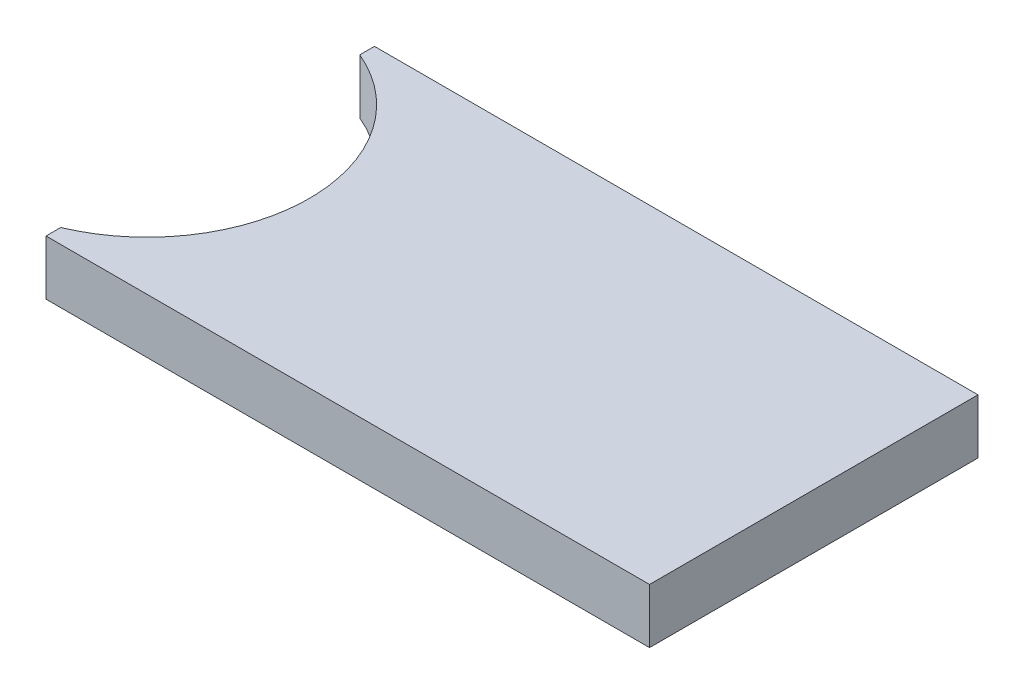
ISO-10303-21;
HEADER;
FILE_DESCRIPTION(('STEP AP214'),'2;1');
FILE_NAME('part.step','',(''),(''),'','','');
FILE_SCHEMA(('AUTOMOTIVE_DESIGN { 1 0 10303 214 1 1 1 1 }'));
ENDSEC;
DATA;
#1=APPLICATION_CONTEXT('core data for automotive mechanical design processes');
#2=APPLICATION_PROTOCOL_DEFINITION('international standard','automotive_design',2000,#1);
#3=PRODUCT_CONTEXT('',#1,'mechanical');
#4=PRODUCT('Part','Part','',(#3));
#5=PRODUCT_RELATED_PRODUCT_CATEGORY('part','',(#4));
#6=PRODUCT_DEFINITION_FORMATION('','',#4);
#7=PRODUCT_DEFINITION_CONTEXT('part definition',#1,'design');
#8=PRODUCT_DEFINITION('design','',#6,#7);
#9=PRODUCT_DEFINITION_SHAPE('','',#8);
#10=(LENGTH_UNIT() NAMED_UNIT(*) SI_UNIT(.MILLI.,.METRE.));
#11=(NAMED_UNIT(*) PLANE_ANGLE_UNIT() SI_UNIT($,.RADIAN.));
#12=(NAMED_UNIT(*) SI_UNIT($,.STERADIAN.) SOLID_ANGLE_UNIT());
#13=UNCERTAINTY_MEASURE_WITH_UNIT(LENGTH_MEASURE(1.E-05),#10,'distance_accuracy_value','');
#14=(GEOMETRIC_REPRESENTATION_CONTEXT(3) GLOBAL_UNCERTAINTY_ASSIGNED_CONTEXT((#13)) GLOBAL_UNIT_ASSIGNED_CONTEXT((#10,
#11,#12)) REPRESENTATION_CONTEXT('',''));
#15=CARTESIAN_POINT('',(0.,0.,0.));
#16=DIRECTION('',(0.,0.,1.));
#17=DIRECTION('',(1.,0.,0.));
#18=AXIS2_PLACEMENT_3D('',#15,#16,#17);
#19=CARTESIAN_POINT('',(110.24962275664,20.,-60.));
#20=DIRECTION('',(-1.,0.,0.));
#21=DIRECTION('',(0.,0.,1.));
#22=AXIS2_PLACEMENT_3D('',#19,#20,#21);
#23=PLANE('',#22);
#24=DIRECTION('',(0.,0.,-1.));
#25=VECTOR('',#24,1.);
#26=CARTESIAN_POINT('',(110.24962275664,0.,-60.));
#27=LINE('',#26,#25);
#28=CARTESIAN_POINT('',(110.24962275664,0.,60.));
#29=VERTEX_POINT('',#28);
#30=CARTESIAN_POINT('',(110.24962275664,0.,-60.));
#31=VERTEX_POINT('',#30);
#32=EDGE_CURVE('E121',#29,#31,#27,.T.);
#33=ORIENTED_EDGE('',*,*,#32,.T.);
#34=DIRECTION('',(0.,-1.,0.));
#35=VECTOR('',#34,1.);
#36=CARTESIAN_POINT('',(110.24962275664,20.,-60.));
#37=LINE('',#36,#35);
#38=CARTESIAN_POINT('',(110.24962275664,20.,-60.));
#39=VERTEX_POINT('',#38);
#40=EDGE_CURVE('E11',#39,#31,#37,.T.);
#41=ORIENTED_EDGE('',*,*,#40,.F.);
#42=DIRECTION('',(0.,0.,-1.));
#43=VECTOR('',#42,1.);
#44=CARTESIAN_POINT('',(110.24962275664,20.,-60.));
#45=LINE('',#44,#43);
#46=CARTESIAN_POINT('',(110.24962275664,20.,60.));
#47=VERTEX_POINT('',#46);
#48=EDGE_CURVE('E131',#47,#39,#45,.T.);
#49=ORIENTED_EDGE('',*,*,#48,.F.);
#50=DIRECTION('',(0.,-1.,0.));
#51=VECTOR('',#50,1.);
#52=CARTESIAN_POINT('',(110.24962275664,20.,60.));
#53=LINE('',#52,#51);
#54=EDGE_CURVE('E117',#47,#29,#53,.T.);
#55=ORIENTED_EDGE('',*,*,#54,.T.);
#56=EDGE_LOOP('',(#33,#41,#49,#55));
#57=FACE_BOUND('',#56,.T.);
#58=ADVANCED_FACE('F37',(#57),#23,.F.);
#59=CARTESIAN_POINT('',(-110.24962275664,20.,-60.));
#60=DIRECTION('',(0.,0.,1.));
#61=DIRECTION('',(1.,0.,0.));
#62=AXIS2_PLACEMENT_3D('',#59,#60,#61);
#63=PLANE('',#62);
#64=DIRECTION('',(-1.,0.,0.));
#65=VECTOR('',#64,1.);
#66=CARTESIAN_POINT('',(-110.24962275664,0.,-60.));
#67=LINE('',#66,#65);
#68=CARTESIAN_POINT('',(-110.24962275664,0.,-60.));
#69=VERTEX_POINT('',#68);
#70=EDGE_CURVE('E124',#31,#69,#67,.T.);
#71=ORIENTED_EDGE('',*,*,#70,.T.);
#72=DIRECTION('',(0.,-1.,0.));
#73=VECTOR('',#72,1.);
#74=CARTESIAN_POINT('',(-110.24962275664,20.,-60.));
#75=LINE('',#74,#73);
#76=CARTESIAN_POINT('',(-110.24962275664,20.,-60.));
#77=VERTEX_POINT('',#76);
#78=EDGE_CURVE('E45',#77,#69,#75,.T.);
#79=ORIENTED_EDGE('',*,*,#78,.F.);
#80=DIRECTION('',(-1.,0.,0.));
#81=VECTOR('',#80,1.);
#82=CARTESIAN_POINT('',(-110.24962275664,20.,-60.));
#83=LINE('',#82,#81);
#84=EDGE_CURVE('E90',#39,#77,#83,.T.);
#85=ORIENTED_EDGE('',*,*,#84,.F.);
#86=ORIENTED_EDGE('',*,*,#40,.T.);
#87=EDGE_LOOP('',(#71,#79,#85,#86));
#88=FACE_BOUND('',#87,.T.);
#89=ADVANCED_FACE('F155',(#88),#63,.F.);
#90=CARTESIAN_POINT('',(-110.24962275664,20.,-60.));
#91=DIRECTION('',(1.,0.,0.));
#92=DIRECTION('',(0.,0.,-1.));
#93=AXIS2_PLACEMENT_3D('',#90,#91,#92);
#94=PLANE('',#93);
#95=DIRECTION('',(0.,0.,1.));
#96=VECTOR('',#95,1.);
#97=CARTESIAN_POINT('',(-110.24962275664,0.,-60.));
#98=LINE('',#97,#96);
#99=CARTESIAN_POINT('',(-110.24962275664,0.,-54.6367530655564));
#100=VERTEX_POINT('',#99);
#101=EDGE_CURVE('E126',#69,#100,#98,.T.);
#102=ORIENTED_EDGE('',*,*,#101,.T.);
#103=DIRECTION('',(0.,-1.,0.));
#104=VECTOR('',#103,1.);
#105=CARTESIAN_POINT('',(-110.24962275664,20.,-54.6367530655564));
#106=LINE('',#105,#104);
#107=CARTESIAN_POINT('',(-110.24962275664,20.,-54.6367530655564));
#108=VERTEX_POINT('',#107);
#109=EDGE_CURVE('E112',#108,#100,#106,.T.);
#110=ORIENTED_EDGE('',*,*,#109,.F.);
#111=DIRECTION('',(0.,0.,1.));
#112=VECTOR('',#111,1.);
#113=CARTESIAN_POINT('',(-110.24962275664,20.,-60.));
#114=LINE('',#113,#112);
#115=EDGE_CURVE('E103',#77,#108,#114,.T.);
#116=ORIENTED_EDGE('',*,*,#115,.F.);
#117=ORIENTED_EDGE('',*,*,#78,.T.);
#118=EDGE_LOOP('',(#102,#110,#116,#117));
#119=FACE_BOUND('',#118,.T.);
#120=ADVANCED_FACE('F137',(#119),#94,.F.);
#121=CARTESIAN_POINT('',(-133.337365114416,20.,0.));
#122=DIRECTION('',(0.,-1.,0.));
#123=DIRECTION('',(0.,0.,-1.));
#124=AXIS2_PLACEMENT_3D('',#121,#122,#123);
#125=CYLINDRICAL_SURFACE('',#124,59.3145735273013);
#126=CARTESIAN_POINT('',(-133.337365114416,0.,0.));
#127=DIRECTION('',(0.,-1.,0.));
#128=DIRECTION('',(0.,0.,-1.));
#129=AXIS2_PLACEMENT_3D('',#126,#127,#128);
#130=CIRCLE('',#129,59.3145735273013);
#131=CARTESIAN_POINT('',(-110.24962275664,0.,54.6367530655564));
#132=VERTEX_POINT('',#131);
#133=EDGE_CURVE('E111',#100,#132,#130,.T.);
#134=ORIENTED_EDGE('',*,*,#133,.T.);
#135=DIRECTION('',(0.,-1.,0.));
#136=VECTOR('',#135,1.);
#137=CARTESIAN_POINT('',(-110.24962275664,20.,54.6367530655564));
#138=LINE('',#137,#136);
#139=CARTESIAN_POINT('',(-110.24962275664,20.,54.6367530655564));
#140=VERTEX_POINT('',#139);
#141=EDGE_CURVE('E108',#140,#132,#138,.T.);
#142=ORIENTED_EDGE('',*,*,#141,.F.);
#143=CARTESIAN_POINT('',(-133.337365114416,20.,0.));
#144=DIRECTION('',(0.,-1.,0.));
#145=DIRECTION('',(0.,0.,-1.));
#146=AXIS2_PLACEMENT_3D('',#143,#144,#145);
#147=CIRCLE('',#146,59.3145735273013);
#148=EDGE_CURVE('E97',#108,#140,#147,.T.);
#149=ORIENTED_EDGE('',*,*,#148,.F.);
#150=ORIENTED_EDGE('',*,*,#109,.T.);
#151=EDGE_LOOP('',(#134,#142,#149,#150));
#152=FACE_BOUND('',#151,.T.);
#153=ADVANCED_FACE('F109',(#152),#125,.F.);
#154=CARTESIAN_POINT('',(-110.24962275664,20.,60.));
#155=DIRECTION('',(1.,0.,0.));
#156=DIRECTION('',(0.,0.,-1.));
#157=AXIS2_PLACEMENT_3D('',#154,#155,#156);
#158=PLANE('',#157);
#159=DIRECTION('',(0.,0.,1.));
#160=VECTOR('',#159,1.);
#161=CARTESIAN_POINT('',(-110.24962275664,0.,60.));
#162=LINE('',#161,#160);
#163=CARTESIAN_POINT('',(-110.24962275664,0.,60.));
#164=VERTEX_POINT('',#163);
#165=EDGE_CURVE('E76',#132,#164,#162,.T.);
#166=ORIENTED_EDGE('',*,*,#165,.T.);
#167=DIRECTION('',(0.,-1.,0.));
#168=VECTOR('',#167,1.);
#169=CARTESIAN_POINT('',(-110.24962275664,20.,60.));
#170=LINE('',#169,#168);
#171=CARTESIAN_POINT('',(-110.24962275664,20.,60.));
#172=VERTEX_POINT('',#171);
#173=EDGE_CURVE('E113',#172,#164,#170,.T.);
#174=ORIENTED_EDGE('',*,*,#173,.F.);
#175=DIRECTION('',(0.,0.,1.));
#176=VECTOR('',#175,1.);
#177=CARTESIAN_POINT('',(-110.24962275664,20.,60.));
#178=LINE('',#177,#176);
#179=EDGE_CURVE('E101',#140,#172,#178,.T.);
#180=ORIENTED_EDGE('',*,*,#179,.F.);
#181=ORIENTED_EDGE('',*,*,#141,.T.);
#182=EDGE_LOOP('',(#166,#174,#180,#181));
#183=FACE_BOUND('',#182,.T.);
#184=ADVANCED_FACE('F115',(#183),#158,.F.);
#185=CARTESIAN_POINT('',(-110.24962275664,20.,60.));
#186=DIRECTION('',(0.,0.,-1.));
#187=DIRECTION('',(-1.,0.,0.));
#188=AXIS2_PLACEMENT_3D('',#185,#186,#187);
#189=PLANE('',#188);
#190=DIRECTION('',(1.,0.,0.));
#191=VECTOR('',#190,1.);
#192=CARTESIAN_POINT('',(-110.24962275664,0.,60.));
#193=LINE('',#192,#191);
#194=EDGE_CURVE('E82',#164,#29,#193,.T.);
#195=ORIENTED_EDGE('',*,*,#194,.T.);
#196=ORIENTED_EDGE('',*,*,#54,.F.);
#197=DIRECTION('',(1.,0.,0.));
#198=VECTOR('',#197,1.);
#199=CARTESIAN_POINT('',(-110.24962275664,20.,60.));
#200=LINE('',#199,#198);
#201=EDGE_CURVE('E53',#172,#47,#200,.T.);
#202=ORIENTED_EDGE('',*,*,#201,.F.);
#203=ORIENTED_EDGE('',*,*,#173,.T.);
#204=EDGE_LOOP('',(#195,#196,#202,#203));
#205=FACE_BOUND('',#204,.T.);
#206=ADVANCED_FACE('F144',(#205),#189,.F.);
#207=CARTESIAN_POINT('',(-133.337365114416,20.,0.));
#208=DIRECTION('',(0.,-1.,0.));
#209=DIRECTION('',(0.,0.,-1.));
#210=AXIS2_PLACEMENT_3D('',#207,#208,#209);
#211=PLANE('',#210);
#212=ORIENTED_EDGE('',*,*,#48,.T.);
#213=ORIENTED_EDGE('',*,*,#84,.T.);
#214=ORIENTED_EDGE('',*,*,#115,.T.);
#215=ORIENTED_EDGE('',*,*,#148,.T.);
#216=ORIENTED_EDGE('',*,*,#179,.T.);
#217=ORIENTED_EDGE('',*,*,#201,.T.);
#218=EDGE_LOOP('',(#212,#213,#214,#215,#216,#217));
#219=FACE_BOUND('',#218,.T.);
#220=ADVANCED_FACE('F99',(#219),#211,.F.);
#221=CARTESIAN_POINT('',(-133.337365114416,0.,0.));
#222=DIRECTION('',(0.,-1.,0.));
#223=DIRECTION('',(0.,0.,-1.));
#224=AXIS2_PLACEMENT_3D('',#221,#222,#223);
#225=PLANE('',#224);
#226=ORIENTED_EDGE('',*,*,#32,.F.);
#227=ORIENTED_EDGE('',*,*,#194,.F.);
#228=ORIENTED_EDGE('',*,*,#165,.F.);
#229=ORIENTED_EDGE('',*,*,#133,.F.);
#230=ORIENTED_EDGE('',*,*,#101,.F.);
#231=ORIENTED_EDGE('',*,*,#70,.F.);
#232=EDGE_LOOP('',(#226,#227,#228,#229,#230,#231));
#233=FACE_BOUND('',#232,.T.);
#234=ADVANCED_FACE('F140',(#233),#225,.T.);
#235=CLOSED_SHELL('',(#58,#89,#120,#153,#184,#206,#220,#234));
#236=MANIFOLD_SOLID_BREP('B2',#235);
#237=ADVANCED_BREP_SHAPE_REPRESENTATION('',(#18,#236),#14);
#238=SHAPE_DEFINITION_REPRESENTATION(#9,#237);
ENDSEC;
END-ISO-10303-21;
